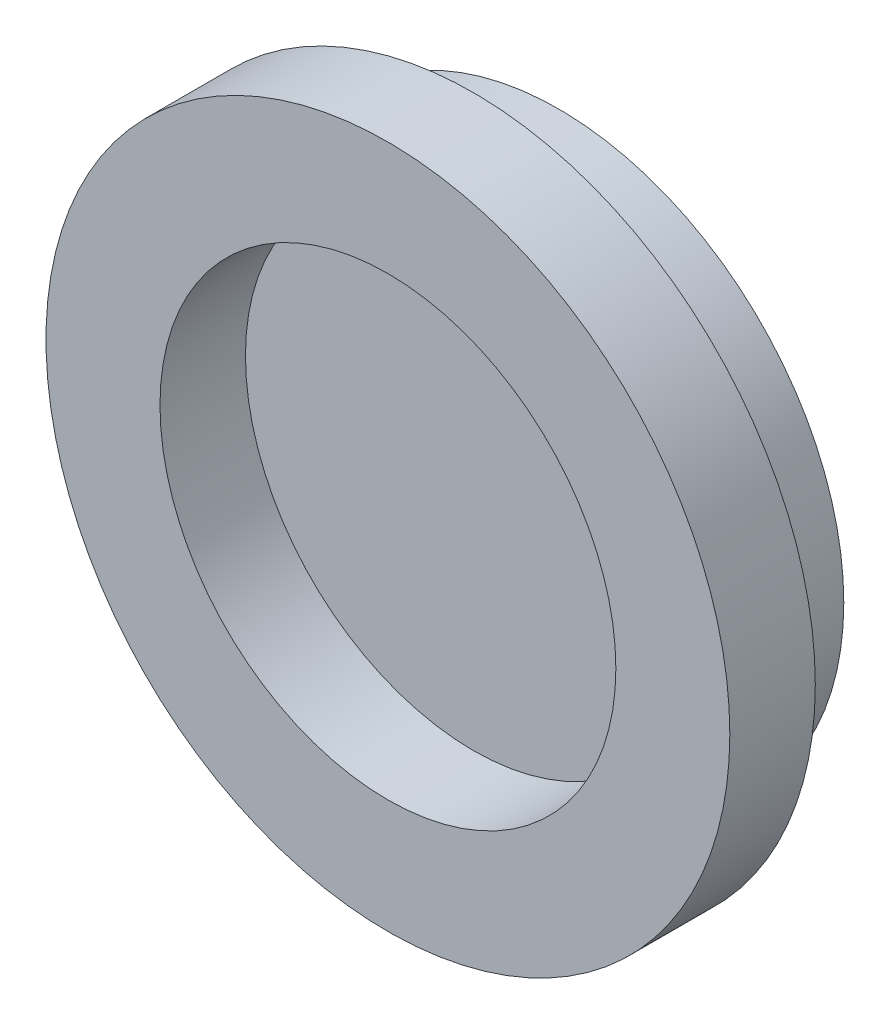
ISO-10303-21;
HEADER;
FILE_DESCRIPTION(('STEP AP214'),'2;1');
FILE_NAME('part.step','',(''),(''),'','','');
FILE_SCHEMA(('AUTOMOTIVE_DESIGN { 1 0 10303 214 1 1 1 1 }'));
ENDSEC;
DATA;
#1=APPLICATION_CONTEXT('core data for automotive mechanical design processes');
#2=APPLICATION_PROTOCOL_DEFINITION('international standard','automotive_design',2000,#1);
#3=PRODUCT_CONTEXT('',#1,'mechanical');
#4=PRODUCT('Part','Part','',(#3));
#5=PRODUCT_RELATED_PRODUCT_CATEGORY('part','',(#4));
#6=PRODUCT_DEFINITION_FORMATION('','',#4);
#7=PRODUCT_DEFINITION_CONTEXT('part definition',#1,'design');
#8=PRODUCT_DEFINITION('design','',#6,#7);
#9=PRODUCT_DEFINITION_SHAPE('','',#8);
#10=(LENGTH_UNIT() NAMED_UNIT(*) SI_UNIT(.MILLI.,.METRE.));
#11=(NAMED_UNIT(*) PLANE_ANGLE_UNIT() SI_UNIT($,.RADIAN.));
#12=(NAMED_UNIT(*) SI_UNIT($,.STERADIAN.) SOLID_ANGLE_UNIT());
#13=UNCERTAINTY_MEASURE_WITH_UNIT(LENGTH_MEASURE(1.E-05),#10,'distance_accuracy_value','');
#14=(GEOMETRIC_REPRESENTATION_CONTEXT(3) GLOBAL_UNCERTAINTY_ASSIGNED_CONTEXT((#13)) GLOBAL_UNIT_ASSIGNED_CONTEXT((#10,
#11,#12)) REPRESENTATION_CONTEXT('',''));
#15=CARTESIAN_POINT('',(0.,0.,0.));
#16=DIRECTION('',(0.,0.,1.));
#17=DIRECTION('',(1.,0.,0.));
#18=AXIS2_PLACEMENT_3D('',#15,#16,#17);
#19=CARTESIAN_POINT('',(0.,0.,3.));
#20=DIRECTION('',(0.,0.,-1.));
#21=DIRECTION('',(-1.,0.,0.));
#22=AXIS2_PLACEMENT_3D('',#19,#20,#21);
#23=CYLINDRICAL_SURFACE('',#22,9.99999999999999);
#24=CARTESIAN_POINT('',(0.,0.,3.));
#25=DIRECTION('',(0.,0.,1.));
#26=DIRECTION('',(1.,0.,0.));
#27=AXIS2_PLACEMENT_3D('',#24,#25,#26);
#28=CIRCLE('',#27,9.99999999999999);
#29=CARTESIAN_POINT('',(9.99999999999999,0.,3.));
#30=VERTEX_POINT('',#29);
#31=EDGE_CURVE('E37',#30,#30,#28,.T.);
#32=ORIENTED_EDGE('',*,*,#31,.F.);
#33=EDGE_LOOP('',(#32));
#34=FACE_BOUND('',#33,.T.);
#35=CARTESIAN_POINT('',(0.,0.,0.));
#36=DIRECTION('',(0.,0.,1.));
#37=DIRECTION('',(1.,0.,0.));
#38=AXIS2_PLACEMENT_3D('',#35,#36,#37);
#39=CIRCLE('',#38,9.99999999999999);
#40=CARTESIAN_POINT('',(9.99999999999999,0.,0.));
#41=VERTEX_POINT('',#40);
#42=EDGE_CURVE('E41',#41,#41,#39,.T.);
#43=ORIENTED_EDGE('',*,*,#42,.T.);
#44=EDGE_LOOP('',(#43));
#45=FACE_BOUND('',#44,.T.);
#46=ADVANCED_FACE('F31',(#34,#45),#23,.T.);
#47=CARTESIAN_POINT('',(0.,0.,0.));
#48=DIRECTION('',(0.,0.,1.));
#49=DIRECTION('',(1.,0.,0.));
#50=AXIS2_PLACEMENT_3D('',#47,#48,#49);
#51=PLANE('',#50);
#52=ORIENTED_EDGE('',*,*,#42,.F.);
#53=EDGE_LOOP('',(#52));
#54=FACE_BOUND('',#53,.T.);
#55=ADVANCED_FACE('F62',(#54),#51,.F.);
#56=CARTESIAN_POINT('',(0.,0.,6.));
#57=DIRECTION('',(0.,0.,1.));
#58=DIRECTION('',(1.,0.,0.));
#59=AXIS2_PLACEMENT_3D('',#56,#57,#58);
#60=PLANE('',#59);
#61=CARTESIAN_POINT('',(0.,0.,6.));
#62=DIRECTION('',(0.,0.,1.));
#63=DIRECTION('',(1.,0.,0.));
#64=AXIS2_PLACEMENT_3D('',#61,#62,#63);
#65=CIRCLE('',#64,12.);
#66=CARTESIAN_POINT('',(12.,0.,6.));
#67=VERTEX_POINT('',#66);
#68=EDGE_CURVE('E46',#67,#67,#65,.T.);
#69=ORIENTED_EDGE('',*,*,#68,.T.);
#70=EDGE_LOOP('',(#69));
#71=FACE_BOUND('',#70,.T.);
#72=CARTESIAN_POINT('',(0.,0.,6.));
#73=DIRECTION('',(0.,0.,1.));
#74=DIRECTION('',(1.,0.,0.));
#75=AXIS2_PLACEMENT_3D('',#72,#73,#74);
#76=CIRCLE('',#75,8.);
#77=CARTESIAN_POINT('',(8.,0.,6.));
#78=VERTEX_POINT('',#77);
#79=EDGE_CURVE('E51',#78,#78,#76,.T.);
#80=ORIENTED_EDGE('',*,*,#79,.F.);
#81=EDGE_LOOP('',(#80));
#82=FACE_BOUND('',#81,.T.);
#83=ADVANCED_FACE('F59',(#71,#82),#60,.T.);
#84=CARTESIAN_POINT('',(0.,0.,3.));
#85=DIRECTION('',(0.,0.,1.));
#86=DIRECTION('',(1.,0.,0.));
#87=AXIS2_PLACEMENT_3D('',#84,#85,#86);
#88=PLANE('',#87);
#89=ORIENTED_EDGE('',*,*,#31,.T.);
#90=EDGE_LOOP('',(#89));
#91=FACE_BOUND('',#90,.T.);
#92=CARTESIAN_POINT('',(0.,0.,3.));
#93=DIRECTION('',(0.,0.,1.));
#94=DIRECTION('',(1.,0.,0.));
#95=AXIS2_PLACEMENT_3D('',#92,#93,#94);
#96=CIRCLE('',#95,12.);
#97=CARTESIAN_POINT('',(12.,0.,3.));
#98=VERTEX_POINT('',#97);
#99=EDGE_CURVE('E48',#98,#98,#96,.T.);
#100=ORIENTED_EDGE('',*,*,#99,.F.);
#101=EDGE_LOOP('',(#100));
#102=FACE_BOUND('',#101,.T.);
#103=ADVANCED_FACE('F61',(#91,#102),#88,.F.);
#104=CARTESIAN_POINT('',(0.,0.,6.));
#105=DIRECTION('',(0.,0.,-1.));
#106=DIRECTION('',(-1.,0.,0.));
#107=AXIS2_PLACEMENT_3D('',#104,#105,#106);
#108=CYLINDRICAL_SURFACE('',#107,12.);
#109=ORIENTED_EDGE('',*,*,#68,.F.);
#110=EDGE_LOOP('',(#109));
#111=FACE_BOUND('',#110,.T.);
#112=ORIENTED_EDGE('',*,*,#99,.T.);
#113=EDGE_LOOP('',(#112));
#114=FACE_BOUND('',#113,.T.);
#115=ADVANCED_FACE('F69',(#111,#114),#108,.T.);
#116=CARTESIAN_POINT('',(0.,0.,6.));
#117=DIRECTION('',(0.,0.,-1.));
#118=DIRECTION('',(-1.,0.,0.));
#119=AXIS2_PLACEMENT_3D('',#116,#117,#118);
#120=CYLINDRICAL_SURFACE('',#119,8.);
#121=ORIENTED_EDGE('',*,*,#79,.T.);
#122=EDGE_LOOP('',(#121));
#123=FACE_BOUND('',#122,.T.);
#124=CARTESIAN_POINT('',(0.,0.,3.));
#125=DIRECTION('',(0.,0.,1.));
#126=DIRECTION('',(1.,0.,0.));
#127=AXIS2_PLACEMENT_3D('',#124,#125,#126);
#128=CIRCLE('',#127,8.);
#129=CARTESIAN_POINT('',(8.,0.,3.));
#130=VERTEX_POINT('',#129);
#131=EDGE_CURVE('E10',#130,#130,#128,.F.);
#132=ORIENTED_EDGE('',*,*,#131,.T.);
#133=EDGE_LOOP('',(#132));
#134=FACE_BOUND('',#133,.T.);
#135=ADVANCED_FACE('F57',(#123,#134),#120,.F.);
#136=CARTESIAN_POINT('',(0.,0.,3.));
#137=DIRECTION('',(0.,0.,1.));
#138=DIRECTION('',(1.,0.,0.));
#139=AXIS2_PLACEMENT_3D('',#136,#137,#138);
#140=PLANE('',#139);
#141=ORIENTED_EDGE('',*,*,#131,.F.);
#142=EDGE_LOOP('',(#141));
#143=FACE_BOUND('',#142,.T.);
#144=ADVANCED_FACE('F112',(#143),#140,.T.);
#145=CLOSED_SHELL('',(#46,#55,#83,#103,#115,#135,#144));
#146=MANIFOLD_SOLID_BREP('B2',#145);
#147=ADVANCED_BREP_SHAPE_REPRESENTATION('',(#18,#146),#14);
#148=SHAPE_DEFINITION_REPRESENTATION(#9,#147);
ENDSEC;
END-ISO-10303-21;
